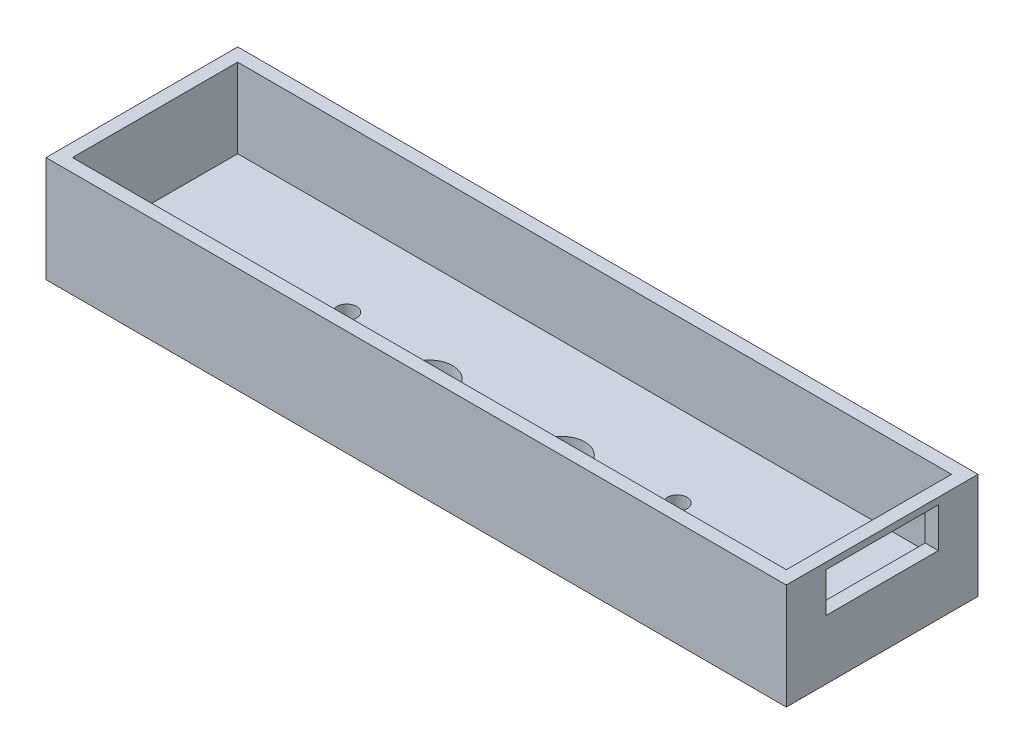
ISO-10303-21;
HEADER;
FILE_DESCRIPTION(('STEP AP214'),'2;1');
FILE_NAME('part.step','',(''),(''),'','','');
FILE_SCHEMA(('AUTOMOTIVE_DESIGN { 1 0 10303 214 1 1 1 1 }'));
ENDSEC;
DATA;
#1=APPLICATION_CONTEXT('core data for automotive mechanical design processes');
#2=APPLICATION_PROTOCOL_DEFINITION('international standard','automotive_design',2000,#1);
#3=PRODUCT_CONTEXT('',#1,'mechanical');
#4=PRODUCT('Part','Part','',(#3));
#5=PRODUCT_RELATED_PRODUCT_CATEGORY('part','',(#4));
#6=PRODUCT_DEFINITION_FORMATION('','',#4);
#7=PRODUCT_DEFINITION_CONTEXT('part definition',#1,'design');
#8=PRODUCT_DEFINITION('design','',#6,#7);
#9=PRODUCT_DEFINITION_SHAPE('','',#8);
#10=(LENGTH_UNIT() NAMED_UNIT(*) SI_UNIT(.MILLI.,.METRE.));
#11=(NAMED_UNIT(*) PLANE_ANGLE_UNIT() SI_UNIT($,.RADIAN.));
#12=(NAMED_UNIT(*) SI_UNIT($,.STERADIAN.) SOLID_ANGLE_UNIT());
#13=UNCERTAINTY_MEASURE_WITH_UNIT(LENGTH_MEASURE(1.E-05),#10,'distance_accuracy_value','');
#14=(GEOMETRIC_REPRESENTATION_CONTEXT(3) GLOBAL_UNCERTAINTY_ASSIGNED_CONTEXT((#13)) GLOBAL_UNIT_ASSIGNED_CONTEXT((#10,
#11,#12)) REPRESENTATION_CONTEXT('',''));
#15=CARTESIAN_POINT('',(0.,0.,0.));
#16=DIRECTION('',(0.,0.,1.));
#17=DIRECTION('',(1.,0.,0.));
#18=AXIS2_PLACEMENT_3D('',#15,#16,#17);
#19=CARTESIAN_POINT('',(1.54454065806863,-0.00100000000000013,-3.78749188362179));
#20=DIRECTION('',(0.,1.,0.));
#21=DIRECTION('',(0.,0.,1.));
#22=AXIS2_PLACEMENT_3D('',#19,#20,#21);
#23=CYLINDRICAL_SURFACE('',#22,1.25);
#24=CARTESIAN_POINT('',(1.54454065806863,0.,-3.78749188362179));
#25=DIRECTION('',(0.,1.,0.));
#26=DIRECTION('',(0.,0.,1.));
#27=AXIS2_PLACEMENT_3D('',#24,#25,#26);
#28=CIRCLE('',#27,1.25);
#29=CARTESIAN_POINT('',(1.54454065806863,0.,-2.53749188362179));
#30=VERTEX_POINT('',#29);
#31=EDGE_CURVE('E299',#30,#30,#28,.F.);
#32=ORIENTED_EDGE('',*,*,#31,.T.);
#33=EDGE_LOOP('',(#32));
#34=FACE_BOUND('',#33,.T.);
#35=CARTESIAN_POINT('',(1.54454065806863,2.3,-3.78749188362179));
#36=DIRECTION('',(0.,1.,0.));
#37=DIRECTION('',(0.,0.,1.));
#38=AXIS2_PLACEMENT_3D('',#35,#36,#37);
#39=CIRCLE('',#38,1.25);
#40=CARTESIAN_POINT('',(1.54454065806863,2.3,-2.53749188362179));
#41=VERTEX_POINT('',#40);
#42=EDGE_CURVE('E115',#41,#41,#39,.F.);
#43=ORIENTED_EDGE('',*,*,#42,.F.);
#44=EDGE_LOOP('',(#43));
#45=FACE_BOUND('',#44,.T.);
#46=ADVANCED_FACE('F111',(#34,#45),#23,.F.);
#47=CARTESIAN_POINT('',(21.5445406580686,-0.00100000000000013,-3.78749188362179));
#48=DIRECTION('',(0.,1.,0.));
#49=DIRECTION('',(0.,0.,1.));
#50=AXIS2_PLACEMENT_3D('',#47,#48,#49);
#51=CYLINDRICAL_SURFACE('',#50,1.25);
#52=CARTESIAN_POINT('',(21.5445406580686,0.,-3.78749188362179));
#53=DIRECTION('',(0.,1.,0.));
#54=DIRECTION('',(0.,0.,1.));
#55=AXIS2_PLACEMENT_3D('',#52,#53,#54);
#56=CIRCLE('',#55,1.25);
#57=CARTESIAN_POINT('',(21.5445406580686,0.,-2.53749188362179));
#58=VERTEX_POINT('',#57);
#59=EDGE_CURVE('E295',#58,#58,#56,.F.);
#60=ORIENTED_EDGE('',*,*,#59,.T.);
#61=EDGE_LOOP('',(#60));
#62=FACE_BOUND('',#61,.T.);
#63=CARTESIAN_POINT('',(21.5445406580686,2.3,-3.78749188362179));
#64=DIRECTION('',(0.,1.,0.));
#65=DIRECTION('',(0.,0.,1.));
#66=AXIS2_PLACEMENT_3D('',#63,#64,#65);
#67=CIRCLE('',#66,1.25);
#68=CARTESIAN_POINT('',(21.5445406580686,2.3,-2.53749188362179));
#69=VERTEX_POINT('',#68);
#70=EDGE_CURVE('E286',#69,#69,#67,.F.);
#71=ORIENTED_EDGE('',*,*,#70,.F.);
#72=EDGE_LOOP('',(#71));
#73=FACE_BOUND('',#72,.T.);
#74=ADVANCED_FACE('F341',(#62,#73),#51,.F.);
#75=CARTESIAN_POINT('',(36.5445406580686,-0.00100000000000013,-6.28749188362179));
#76=DIRECTION('',(0.,1.,0.));
#77=DIRECTION('',(0.,0.,1.));
#78=AXIS2_PLACEMENT_3D('',#75,#76,#77);
#79=CYLINDRICAL_SURFACE('',#78,1.5);
#80=CARTESIAN_POINT('',(36.5445406580686,4.,-6.28749188362179));
#81=DIRECTION('',(0.,1.,0.));
#82=DIRECTION('',(0.,0.,1.));
#83=AXIS2_PLACEMENT_3D('',#80,#81,#82);
#84=CIRCLE('',#83,1.5);
#85=CARTESIAN_POINT('',(36.5445406580686,4.,-4.78749188362179));
#86=VERTEX_POINT('',#85);
#87=EDGE_CURVE('E321',#86,#86,#84,.T.);
#88=ORIENTED_EDGE('',*,*,#87,.T.);
#89=EDGE_LOOP('',(#88));
#90=FACE_BOUND('',#89,.T.);
#91=CARTESIAN_POINT('',(36.5445406580686,2.,-6.28749188362179));
#92=DIRECTION('',(0.,-1.,0.));
#93=DIRECTION('',(0.,0.,-1.));
#94=AXIS2_PLACEMENT_3D('',#91,#92,#93);
#95=CIRCLE('',#94,1.5);
#96=CARTESIAN_POINT('',(36.5445406580686,2.,-7.78749188362179));
#97=VERTEX_POINT('',#96);
#98=EDGE_CURVE('E309',#97,#97,#95,.F.);
#99=ORIENTED_EDGE('',*,*,#98,.F.);
#100=EDGE_LOOP('',(#99));
#101=FACE_BOUND('',#100,.T.);
#102=ADVANCED_FACE('F347',(#90,#101),#79,.F.);
#103=CARTESIAN_POINT('',(-13.4554593419314,-0.00100000000000013,-6.28749188362179));
#104=DIRECTION('',(0.,1.,0.));
#105=DIRECTION('',(0.,0.,1.));
#106=AXIS2_PLACEMENT_3D('',#103,#104,#105);
#107=CYLINDRICAL_SURFACE('',#106,1.5);
#108=CARTESIAN_POINT('',(-13.4554593419314,4.,-6.28749188362179));
#109=DIRECTION('',(0.,1.,0.));
#110=DIRECTION('',(0.,0.,1.));
#111=AXIS2_PLACEMENT_3D('',#108,#109,#110);
#112=CIRCLE('',#111,1.5);
#113=CARTESIAN_POINT('',(-13.4554593419314,4.,-4.78749188362179));
#114=VERTEX_POINT('',#113);
#115=EDGE_CURVE('E317',#114,#114,#112,.T.);
#116=ORIENTED_EDGE('',*,*,#115,.T.);
#117=EDGE_LOOP('',(#116));
#118=FACE_BOUND('',#117,.T.);
#119=CARTESIAN_POINT('',(-13.4554593419314,2.,-6.28749188362179));
#120=DIRECTION('',(0.,-1.,0.));
#121=DIRECTION('',(0.,0.,-1.));
#122=AXIS2_PLACEMENT_3D('',#119,#120,#121);
#123=CIRCLE('',#122,1.5);
#124=CARTESIAN_POINT('',(-13.4554593419314,2.,-7.78749188362179));
#125=VERTEX_POINT('',#124);
#126=EDGE_CURVE('E302',#125,#125,#123,.F.);
#127=ORIENTED_EDGE('',*,*,#126,.F.);
#128=EDGE_LOOP('',(#127));
#129=FACE_BOUND('',#128,.T.);
#130=ADVANCED_FACE('F369',(#118,#129),#107,.F.);
#131=CARTESIAN_POINT('',(0.,4.,0.));
#132=DIRECTION('',(0.,1.,0.));
#133=DIRECTION('',(0.,0.,1.));
#134=AXIS2_PLACEMENT_3D('',#131,#132,#133);
#135=PLANE('',#134);
#136=CARTESIAN_POINT('',(21.5445406580686,4.,-3.78749188362179));
#137=DIRECTION('',(0.,1.,0.));
#138=DIRECTION('',(0.,0.,1.));
#139=AXIS2_PLACEMENT_3D('',#136,#137,#138);
#140=CIRCLE('',#139,3.5);
#141=CARTESIAN_POINT('',(21.5445406580686,4.,-0.287491883621789));
#142=VERTEX_POINT('',#141);
#143=EDGE_CURVE('E287',#142,#142,#140,.T.);
#144=ORIENTED_EDGE('',*,*,#143,.F.);
#145=EDGE_LOOP('',(#144));
#146=FACE_BOUND('',#145,.T.);
#147=CARTESIAN_POINT('',(1.54454065806863,4.,-3.78749188362179));
#148=DIRECTION('',(0.,1.,0.));
#149=DIRECTION('',(0.,0.,1.));
#150=AXIS2_PLACEMENT_3D('',#147,#148,#149);
#151=CIRCLE('',#150,3.5);
#152=CARTESIAN_POINT('',(1.54454065806863,4.,-0.287491883621789));
#153=VERTEX_POINT('',#152);
#154=EDGE_CURVE('E273',#153,#153,#151,.T.);
#155=ORIENTED_EDGE('',*,*,#154,.F.);
#156=EDGE_LOOP('',(#155));
#157=FACE_BOUND('',#156,.T.);
#158=ORIENTED_EDGE('',*,*,#115,.F.);
#159=EDGE_LOOP('',(#158));
#160=FACE_BOUND('',#159,.T.);
#161=ORIENTED_EDGE('',*,*,#87,.F.);
#162=EDGE_LOOP('',(#161));
#163=FACE_BOUND('',#162,.T.);
#164=DIRECTION('',(0.,0.,1.));
#165=VECTOR('',#164,1.);
#166=CARTESIAN_POINT('',(-42.4554593419314,4.,-18.7874918836218));
#167=LINE('',#166,#165);
#168=CARTESIAN_POINT('',(-42.4554593419314,4.,-18.7874918836218));
#169=VERTEX_POINT('',#168);
#170=CARTESIAN_POINT('',(-42.4554593419314,4.,6.21250811637821));
#171=VERTEX_POINT('',#170);
#172=EDGE_CURVE('E320',#169,#171,#167,.T.);
#173=ORIENTED_EDGE('',*,*,#172,.T.);
#174=DIRECTION('',(1.,0.,0.));
#175=VECTOR('',#174,1.);
#176=CARTESIAN_POINT('',(-42.4554593419314,4.,6.21250811637821));
#177=LINE('',#176,#175);
#178=CARTESIAN_POINT('',(65.5445406580686,4.,6.21250811637821));
#179=VERTEX_POINT('',#178);
#180=EDGE_CURVE('E326',#171,#179,#177,.T.);
#181=ORIENTED_EDGE('',*,*,#180,.T.);
#182=DIRECTION('',(0.,0.,-1.));
#183=VECTOR('',#182,1.);
#184=CARTESIAN_POINT('',(65.5445406580686,4.,-18.7874918836218));
#185=LINE('',#184,#183);
#186=CARTESIAN_POINT('',(65.5445406580686,4.,-18.7874918836218));
#187=VERTEX_POINT('',#186);
#188=EDGE_CURVE('E120',#179,#187,#185,.T.);
#189=ORIENTED_EDGE('',*,*,#188,.T.);
#190=DIRECTION('',(-1.,0.,0.));
#191=VECTOR('',#190,1.);
#192=CARTESIAN_POINT('',(-42.4554593419314,4.,-18.7874918836218));
#193=LINE('',#192,#191);
#194=EDGE_CURVE('E12',#187,#169,#193,.T.);
#195=ORIENTED_EDGE('',*,*,#194,.T.);
#196=EDGE_LOOP('',(#173,#181,#189,#195));
#197=FACE_BOUND('',#196,.T.);
#198=ADVANCED_FACE('F372',(#146,#157,#160,#163,#197),#135,.T.);
#199=CARTESIAN_POINT('',(0.,0.,0.));
#200=DIRECTION('',(0.,1.,0.));
#201=DIRECTION('',(0.,0.,1.));
#202=AXIS2_PLACEMENT_3D('',#199,#200,#201);
#203=PLANE('',#202);
#204=ORIENTED_EDGE('',*,*,#59,.F.);
#205=EDGE_LOOP('',(#204));
#206=FACE_BOUND('',#205,.T.);
#207=ORIENTED_EDGE('',*,*,#31,.F.);
#208=EDGE_LOOP('',(#207));
#209=FACE_BOUND('',#208,.T.);
#210=CARTESIAN_POINT('',(-13.4554593419314,0.,-6.28749188362179));
#211=DIRECTION('',(0.,-1.,0.));
#212=DIRECTION('',(0.,0.,-1.));
#213=AXIS2_PLACEMENT_3D('',#210,#211,#212);
#214=CIRCLE('',#213,3.5);
#215=CARTESIAN_POINT('',(-13.4554593419314,0.,-9.78749188362179));
#216=VERTEX_POINT('',#215);
#217=EDGE_CURVE('E306',#216,#216,#214,.T.);
#218=ORIENTED_EDGE('',*,*,#217,.F.);
#219=EDGE_LOOP('',(#218));
#220=FACE_BOUND('',#219,.T.);
#221=CARTESIAN_POINT('',(36.5445406580686,0.,-6.28749188362179));
#222=DIRECTION('',(0.,-1.,0.));
#223=DIRECTION('',(0.,0.,-1.));
#224=AXIS2_PLACEMENT_3D('',#221,#222,#223);
#225=CIRCLE('',#224,3.5);
#226=CARTESIAN_POINT('',(36.5445406580686,0.,-9.78749188362179));
#227=VERTEX_POINT('',#226);
#228=EDGE_CURVE('E312',#227,#227,#225,.T.);
#229=ORIENTED_EDGE('',*,*,#228,.F.);
#230=EDGE_LOOP('',(#229));
#231=FACE_BOUND('',#230,.T.);
#232=DIRECTION('',(-1.,0.,0.));
#233=VECTOR('',#232,1.);
#234=CARTESIAN_POINT('',(0.,0.,-20.7874918836218));
#235=LINE('',#234,#233);
#236=CARTESIAN_POINT('',(67.5445406580686,0.,-20.7874918836218));
#237=VERTEX_POINT('',#236);
#238=CARTESIAN_POINT('',(-44.4554593419314,0.,-20.7874918836218));
#239=VERTEX_POINT('',#238);
#240=EDGE_CURVE('E260',#237,#239,#235,.T.);
#241=ORIENTED_EDGE('',*,*,#240,.F.);
#242=DIRECTION('',(0.,0.,1.));
#243=VECTOR('',#242,1.);
#244=CARTESIAN_POINT('',(67.5445406580686,0.,0.));
#245=LINE('',#244,#243);
#246=CARTESIAN_POINT('',(67.5445406580686,0.,8.21250811637821));
#247=VERTEX_POINT('',#246);
#248=EDGE_CURVE('E268',#237,#247,#245,.T.);
#249=ORIENTED_EDGE('',*,*,#248,.T.);
#250=DIRECTION('',(-1.,0.,0.));
#251=VECTOR('',#250,1.);
#252=CARTESIAN_POINT('',(0.,0.,8.21250811637822));
#253=LINE('',#252,#251);
#254=CARTESIAN_POINT('',(-44.4554593419314,0.,8.21250811637823));
#255=VERTEX_POINT('',#254);
#256=EDGE_CURVE('E266',#247,#255,#253,.T.);
#257=ORIENTED_EDGE('',*,*,#256,.T.);
#258=DIRECTION('',(0.,0.,1.));
#259=VECTOR('',#258,1.);
#260=CARTESIAN_POINT('',(-44.4554593419314,0.,0.));
#261=LINE('',#260,#259);
#262=EDGE_CURVE('E263',#239,#255,#261,.T.);
#263=ORIENTED_EDGE('',*,*,#262,.F.);
#264=EDGE_LOOP('',(#241,#249,#257,#263));
#265=FACE_BOUND('',#264,.T.);
#266=ADVANCED_FACE('F113',(#206,#209,#220,#231,#265),#203,.F.);
#267=CARTESIAN_POINT('',(-13.4554593419314,2.,-6.28749188362179));
#268=DIRECTION('',(0.,-1.,0.));
#269=DIRECTION('',(0.,0.,-1.));
#270=AXIS2_PLACEMENT_3D('',#267,#268,#269);
#271=CYLINDRICAL_SURFACE('',#270,3.5);
#272=CARTESIAN_POINT('',(-13.4554593419314,2.,-6.28749188362179));
#273=DIRECTION('',(0.,-1.,0.));
#274=DIRECTION('',(0.,0.,-1.));
#275=AXIS2_PLACEMENT_3D('',#272,#273,#274);
#276=CIRCLE('',#275,3.5);
#277=CARTESIAN_POINT('',(-13.4554593419314,2.,-9.78749188362179));
#278=VERTEX_POINT('',#277);
#279=EDGE_CURVE('E305',#278,#278,#276,.T.);
#280=ORIENTED_EDGE('',*,*,#279,.F.);
#281=EDGE_LOOP('',(#280));
#282=FACE_BOUND('',#281,.T.);
#283=ORIENTED_EDGE('',*,*,#217,.T.);
#284=EDGE_LOOP('',(#283));
#285=FACE_BOUND('',#284,.T.);
#286=ADVANCED_FACE('F356',(#282,#285),#271,.F.);
#287=CARTESIAN_POINT('',(0.,2.,0.));
#288=DIRECTION('',(0.,-1.,0.));
#289=DIRECTION('',(0.,0.,-1.));
#290=AXIS2_PLACEMENT_3D('',#287,#288,#289);
#291=PLANE('',#290);
#292=ORIENTED_EDGE('',*,*,#126,.T.);
#293=EDGE_LOOP('',(#292));
#294=FACE_BOUND('',#293,.T.);
#295=ORIENTED_EDGE('',*,*,#279,.T.);
#296=EDGE_LOOP('',(#295));
#297=FACE_BOUND('',#296,.T.);
#298=ADVANCED_FACE('F352',(#294,#297),#291,.T.);
#299=CARTESIAN_POINT('',(36.5445406580686,2.,-6.28749188362179));
#300=DIRECTION('',(0.,-1.,0.));
#301=DIRECTION('',(0.,0.,-1.));
#302=AXIS2_PLACEMENT_3D('',#299,#300,#301);
#303=PLANE('',#302);
#304=CARTESIAN_POINT('',(36.5445406580686,2.,-6.28749188362179));
#305=DIRECTION('',(0.,-1.,0.));
#306=DIRECTION('',(0.,0.,-1.));
#307=AXIS2_PLACEMENT_3D('',#304,#305,#306);
#308=CIRCLE('',#307,3.5);
#309=CARTESIAN_POINT('',(36.5445406580686,2.,-9.78749188362179));
#310=VERTEX_POINT('',#309);
#311=EDGE_CURVE('E298',#310,#310,#308,.T.);
#312=ORIENTED_EDGE('',*,*,#311,.T.);
#313=EDGE_LOOP('',(#312));
#314=FACE_BOUND('',#313,.T.);
#315=ORIENTED_EDGE('',*,*,#98,.T.);
#316=EDGE_LOOP('',(#315));
#317=FACE_BOUND('',#316,.T.);
#318=ADVANCED_FACE('F355',(#314,#317),#303,.T.);
#319=CARTESIAN_POINT('',(36.5445406580686,2.,-6.28749188362179));
#320=DIRECTION('',(0.,-1.,0.));
#321=DIRECTION('',(0.,0.,-1.));
#322=AXIS2_PLACEMENT_3D('',#319,#320,#321);
#323=CYLINDRICAL_SURFACE('',#322,3.5);
#324=ORIENTED_EDGE('',*,*,#311,.F.);
#325=EDGE_LOOP('',(#324));
#326=FACE_BOUND('',#325,.T.);
#327=ORIENTED_EDGE('',*,*,#228,.T.);
#328=EDGE_LOOP('',(#327));
#329=FACE_BOUND('',#328,.T.);
#330=ADVANCED_FACE('F361',(#326,#329),#323,.F.);
#331=CARTESIAN_POINT('',(21.5445406580686,2.3,-3.78749188362179));
#332=DIRECTION('',(0.,1.,0.));
#333=DIRECTION('',(0.,0.,1.));
#334=AXIS2_PLACEMENT_3D('',#331,#332,#333);
#335=PLANE('',#334);
#336=CARTESIAN_POINT('',(21.5445406580686,2.3,-3.78749188362179));
#337=DIRECTION('',(0.,1.,0.));
#338=DIRECTION('',(0.,0.,1.));
#339=AXIS2_PLACEMENT_3D('',#336,#337,#338);
#340=CIRCLE('',#339,3.5);
#341=CARTESIAN_POINT('',(21.5445406580686,2.3,-0.287491883621789));
#342=VERTEX_POINT('',#341);
#343=EDGE_CURVE('E283',#342,#342,#340,.T.);
#344=ORIENTED_EDGE('',*,*,#343,.T.);
#345=EDGE_LOOP('',(#344));
#346=FACE_BOUND('',#345,.T.);
#347=ORIENTED_EDGE('',*,*,#70,.T.);
#348=EDGE_LOOP('',(#347));
#349=FACE_BOUND('',#348,.T.);
#350=ADVANCED_FACE('F364',(#346,#349),#335,.T.);
#351=CARTESIAN_POINT('',(21.5445406580686,2.3,-3.78749188362179));
#352=DIRECTION('',(0.,1.,0.));
#353=DIRECTION('',(0.,0.,1.));
#354=AXIS2_PLACEMENT_3D('',#351,#352,#353);
#355=CYLINDRICAL_SURFACE('',#354,3.5);
#356=ORIENTED_EDGE('',*,*,#343,.F.);
#357=EDGE_LOOP('',(#356));
#358=FACE_BOUND('',#357,.T.);
#359=ORIENTED_EDGE('',*,*,#143,.T.);
#360=EDGE_LOOP('',(#359));
#361=FACE_BOUND('',#360,.T.);
#362=ADVANCED_FACE('F439',(#358,#361),#355,.F.);
#363=CARTESIAN_POINT('',(1.54454065806863,2.3,-3.78749188362179));
#364=DIRECTION('',(0.,1.,0.));
#365=DIRECTION('',(0.,0.,1.));
#366=AXIS2_PLACEMENT_3D('',#363,#364,#365);
#367=PLANE('',#366);
#368=CARTESIAN_POINT('',(1.54454065806863,2.3,-3.78749188362179));
#369=DIRECTION('',(0.,1.,0.));
#370=DIRECTION('',(0.,0.,1.));
#371=AXIS2_PLACEMENT_3D('',#368,#369,#370);
#372=CIRCLE('',#371,3.5);
#373=CARTESIAN_POINT('',(1.54454065806863,2.3,-0.287491883621789));
#374=VERTEX_POINT('',#373);
#375=EDGE_CURVE('E290',#374,#374,#372,.T.);
#376=ORIENTED_EDGE('',*,*,#375,.T.);
#377=EDGE_LOOP('',(#376));
#378=FACE_BOUND('',#377,.T.);
#379=ORIENTED_EDGE('',*,*,#42,.T.);
#380=EDGE_LOOP('',(#379));
#381=FACE_BOUND('',#380,.T.);
#382=ADVANCED_FACE('F338',(#378,#381),#367,.T.);
#383=CARTESIAN_POINT('',(1.54454065806863,2.3,-3.78749188362179));
#384=DIRECTION('',(0.,1.,0.));
#385=DIRECTION('',(0.,0.,1.));
#386=AXIS2_PLACEMENT_3D('',#383,#384,#385);
#387=CYLINDRICAL_SURFACE('',#386,3.5);
#388=ORIENTED_EDGE('',*,*,#375,.F.);
#389=EDGE_LOOP('',(#388));
#390=FACE_BOUND('',#389,.T.);
#391=ORIENTED_EDGE('',*,*,#154,.T.);
#392=EDGE_LOOP('',(#391));
#393=FACE_BOUND('',#392,.T.);
#394=ADVANCED_FACE('F412',(#390,#393),#387,.F.);
#395=CARTESIAN_POINT('',(0.,16.,0.));
#396=DIRECTION('',(0.,1.,0.));
#397=DIRECTION('',(0.,0.,1.));
#398=AXIS2_PLACEMENT_3D('',#395,#396,#397);
#399=PLANE('',#398);
#400=DIRECTION('',(0.,0.,1.));
#401=VECTOR('',#400,1.);
#402=CARTESIAN_POINT('',(65.5445406580686,16.,-18.7874918836218));
#403=LINE('',#402,#401);
#404=CARTESIAN_POINT('',(65.5445406580686,16.,-18.7874918836218));
#405=VERTEX_POINT('',#404);
#406=CARTESIAN_POINT('',(65.5445406580686,16.,6.21250811637821));
#407=VERTEX_POINT('',#406);
#408=EDGE_CURVE('E223',#405,#407,#403,.T.);
#409=ORIENTED_EDGE('',*,*,#408,.T.);
#410=DIRECTION('',(-1.,0.,0.));
#411=VECTOR('',#410,1.);
#412=CARTESIAN_POINT('',(0.,16.,6.21250811637822));
#413=LINE('',#412,#411);
#414=CARTESIAN_POINT('',(-42.4554593419314,16.,6.21250811637822));
#415=VERTEX_POINT('',#414);
#416=EDGE_CURVE('E251',#407,#415,#413,.T.);
#417=ORIENTED_EDGE('',*,*,#416,.T.);
#418=DIRECTION('',(0.,0.,1.));
#419=VECTOR('',#418,1.);
#420=CARTESIAN_POINT('',(-42.4554593419314,16.,0.));
#421=LINE('',#420,#419);
#422=CARTESIAN_POINT('',(-42.4554593419314,16.,-18.7874918836218));
#423=VERTEX_POINT('',#422);
#424=EDGE_CURVE('E254',#423,#415,#421,.T.);
#425=ORIENTED_EDGE('',*,*,#424,.F.);
#426=DIRECTION('',(1.,0.,0.));
#427=VECTOR('',#426,1.);
#428=CARTESIAN_POINT('',(0.,16.,-18.7874918836218));
#429=LINE('',#428,#427);
#430=EDGE_CURVE('E257',#423,#405,#429,.T.);
#431=ORIENTED_EDGE('',*,*,#430,.T.);
#432=EDGE_LOOP('',(#409,#417,#425,#431));
#433=FACE_BOUND('',#432,.T.);
#434=DIRECTION('',(-1.,0.,0.));
#435=VECTOR('',#434,1.);
#436=CARTESIAN_POINT('',(0.,16.,-20.7874918836218));
#437=LINE('',#436,#435);
#438=CARTESIAN_POINT('',(67.5445406580686,16.,-20.7874918836218));
#439=VERTEX_POINT('',#438);
#440=CARTESIAN_POINT('',(-44.4554593419314,16.,-20.7874918836218));
#441=VERTEX_POINT('',#440);
#442=EDGE_CURVE('E237',#439,#441,#437,.T.);
#443=ORIENTED_EDGE('',*,*,#442,.T.);
#444=DIRECTION('',(0.,0.,1.));
#445=VECTOR('',#444,1.);
#446=CARTESIAN_POINT('',(-44.4554593419314,16.,0.));
#447=LINE('',#446,#445);
#448=CARTESIAN_POINT('',(-44.4554593419314,16.,8.21250811637823));
#449=VERTEX_POINT('',#448);
#450=EDGE_CURVE('E242',#441,#449,#447,.T.);
#451=ORIENTED_EDGE('',*,*,#450,.T.);
#452=DIRECTION('',(-1.,0.,0.));
#453=VECTOR('',#452,1.);
#454=CARTESIAN_POINT('',(0.,16.,8.21250811637822));
#455=LINE('',#454,#453);
#456=CARTESIAN_POINT('',(67.5445406580686,16.,8.21250811637821));
#457=VERTEX_POINT('',#456);
#458=EDGE_CURVE('E245',#457,#449,#455,.T.);
#459=ORIENTED_EDGE('',*,*,#458,.F.);
#460=DIRECTION('',(0.,0.,1.));
#461=VECTOR('',#460,1.);
#462=CARTESIAN_POINT('',(67.5445406580686,16.,0.));
#463=LINE('',#462,#461);
#464=EDGE_CURVE('E248',#439,#457,#463,.T.);
#465=ORIENTED_EDGE('',*,*,#464,.F.);
#466=EDGE_LOOP('',(#443,#451,#459,#465));
#467=FACE_BOUND('',#466,.T.);
#468=ADVANCED_FACE('F400',(#433,#467),#399,.T.);
#469=CARTESIAN_POINT('',(65.5445406580686,16.,-18.7874918836218));
#470=DIRECTION('',(1.,0.,0.));
#471=DIRECTION('',(0.,0.,-1.));
#472=AXIS2_PLACEMENT_3D('',#469,#470,#471);
#473=PLANE('',#472);
#474=DIRECTION('',(0.,0.,-1.));
#475=VECTOR('',#474,1.);
#476=CARTESIAN_POINT('',(65.5445406580686,15.,2.21250811637821));
#477=LINE('',#476,#475);
#478=CARTESIAN_POINT('',(65.5445406580686,15.,2.21250811637821));
#479=VERTEX_POINT('',#478);
#480=CARTESIAN_POINT('',(65.5445406580686,15.,-14.7874918836218));
#481=VERTEX_POINT('',#480);
#482=EDGE_CURVE('E206',#479,#481,#477,.T.);
#483=ORIENTED_EDGE('',*,*,#482,.F.);
#484=DIRECTION('',(0.,1.,0.));
#485=VECTOR('',#484,1.);
#486=CARTESIAN_POINT('',(65.5445406580686,9.,2.21250811637821));
#487=LINE('',#486,#485);
#488=CARTESIAN_POINT('',(65.5445406580686,9.,2.21250811637821));
#489=VERTEX_POINT('',#488);
#490=EDGE_CURVE('E213',#489,#479,#487,.T.);
#491=ORIENTED_EDGE('',*,*,#490,.F.);
#492=DIRECTION('',(0.,0.,1.));
#493=VECTOR('',#492,1.);
#494=CARTESIAN_POINT('',(65.5445406580686,9.,2.21250811637821));
#495=LINE('',#494,#493);
#496=CARTESIAN_POINT('',(65.5445406580686,9.,-14.7874918836218));
#497=VERTEX_POINT('',#496);
#498=EDGE_CURVE('E218',#497,#489,#495,.T.);
#499=ORIENTED_EDGE('',*,*,#498,.F.);
#500=DIRECTION('',(0.,-1.,0.));
#501=VECTOR('',#500,1.);
#502=CARTESIAN_POINT('',(65.5445406580686,9.,-14.7874918836218));
#503=LINE('',#502,#501);
#504=EDGE_CURVE('E128',#481,#497,#503,.T.);
#505=ORIENTED_EDGE('',*,*,#504,.F.);
#506=EDGE_LOOP('',(#483,#491,#499,#505));
#507=FACE_BOUND('',#506,.T.);
#508=ORIENTED_EDGE('',*,*,#188,.F.);
#509=DIRECTION('',(0.,-1.,0.));
#510=VECTOR('',#509,1.);
#511=CARTESIAN_POINT('',(65.5445406580686,16.,6.21250811637821));
#512=LINE('',#511,#510);
#513=EDGE_CURVE('E233',#407,#179,#512,.T.);
#514=ORIENTED_EDGE('',*,*,#513,.F.);
#515=ORIENTED_EDGE('',*,*,#408,.F.);
#516=DIRECTION('',(0.,-1.,0.));
#517=VECTOR('',#516,1.);
#518=CARTESIAN_POINT('',(65.5445406580686,16.,-18.7874918836218));
#519=LINE('',#518,#517);
#520=EDGE_CURVE('E234',#405,#187,#519,.T.);
#521=ORIENTED_EDGE('',*,*,#520,.T.);
#522=EDGE_LOOP('',(#508,#514,#515,#521));
#523=FACE_BOUND('',#522,.T.);
#524=ADVANCED_FACE('F220',(#507,#523),#473,.F.);
#525=CARTESIAN_POINT('',(0.,0.,-18.7874918836218));
#526=DIRECTION('',(0.,0.,1.));
#527=DIRECTION('',(1.,0.,0.));
#528=AXIS2_PLACEMENT_3D('',#525,#526,#527);
#529=PLANE('',#528);
#530=DIRECTION('',(0.,1.,0.));
#531=VECTOR('',#530,1.);
#532=CARTESIAN_POINT('',(-42.4554593419314,0.,-18.7874918836218));
#533=LINE('',#532,#531);
#534=EDGE_CURVE('E274',#169,#423,#533,.T.);
#535=ORIENTED_EDGE('',*,*,#534,.F.);
#536=ORIENTED_EDGE('',*,*,#194,.F.);
#537=ORIENTED_EDGE('',*,*,#520,.F.);
#538=ORIENTED_EDGE('',*,*,#430,.F.);
#539=EDGE_LOOP('',(#535,#536,#537,#538));
#540=FACE_BOUND('',#539,.T.);
#541=ADVANCED_FACE('F396',(#540),#529,.T.);
#542=CARTESIAN_POINT('',(0.,0.,6.21250811637822));
#543=DIRECTION('',(0.,0.,-1.));
#544=DIRECTION('',(-1.,0.,0.));
#545=AXIS2_PLACEMENT_3D('',#542,#543,#544);
#546=PLANE('',#545);
#547=ORIENTED_EDGE('',*,*,#513,.T.);
#548=ORIENTED_EDGE('',*,*,#180,.F.);
#549=DIRECTION('',(0.,1.,0.));
#550=VECTOR('',#549,1.);
#551=CARTESIAN_POINT('',(-42.4554593419314,0.,6.21250811637822));
#552=LINE('',#551,#550);
#553=EDGE_CURVE('E276',#171,#415,#552,.T.);
#554=ORIENTED_EDGE('',*,*,#553,.T.);
#555=ORIENTED_EDGE('',*,*,#416,.F.);
#556=EDGE_LOOP('',(#547,#548,#554,#555));
#557=FACE_BOUND('',#556,.T.);
#558=ADVANCED_FACE('F404',(#557),#546,.T.);
#559=CARTESIAN_POINT('',(0.,0.,-20.7874918836218));
#560=DIRECTION('',(0.,0.,-1.));
#561=DIRECTION('',(-1.,0.,0.));
#562=AXIS2_PLACEMENT_3D('',#559,#560,#561);
#563=PLANE('',#562);
#564=DIRECTION('',(0.,1.,0.));
#565=VECTOR('',#564,1.);
#566=CARTESIAN_POINT('',(-44.4554593419314,0.,-20.7874918836218));
#567=LINE('',#566,#565);
#568=EDGE_CURVE('E270',#239,#441,#567,.T.);
#569=ORIENTED_EDGE('',*,*,#568,.T.);
#570=ORIENTED_EDGE('',*,*,#442,.F.);
#571=DIRECTION('',(0.,1.,0.));
#572=VECTOR('',#571,1.);
#573=CARTESIAN_POINT('',(67.5445406580686,0.,-20.7874918836218));
#574=LINE('',#573,#572);
#575=EDGE_CURVE('E271',#237,#439,#574,.T.);
#576=ORIENTED_EDGE('',*,*,#575,.F.);
#577=ORIENTED_EDGE('',*,*,#240,.T.);
#578=EDGE_LOOP('',(#569,#570,#576,#577));
#579=FACE_BOUND('',#578,.T.);
#580=ADVANCED_FACE('F419',(#579),#563,.T.);
#581=CARTESIAN_POINT('',(67.5445406580686,0.,0.));
#582=DIRECTION('',(-1.,0.,0.));
#583=DIRECTION('',(0.,0.,1.));
#584=AXIS2_PLACEMENT_3D('',#581,#582,#583);
#585=PLANE('',#584);
#586=DIRECTION('',(0.,0.,-1.));
#587=VECTOR('',#586,1.);
#588=CARTESIAN_POINT('',(67.5445406580686,9.,2.21250811637821));
#589=LINE('',#588,#587);
#590=CARTESIAN_POINT('',(67.5445406580686,9.,2.21250811637821));
#591=VERTEX_POINT('',#590);
#592=CARTESIAN_POINT('',(67.5445406580686,9.,-14.7874918836218));
#593=VERTEX_POINT('',#592);
#594=EDGE_CURVE('E562',#591,#593,#589,.T.);
#595=ORIENTED_EDGE('',*,*,#594,.F.);
#596=DIRECTION('',(0.,-1.,0.));
#597=VECTOR('',#596,1.);
#598=CARTESIAN_POINT('',(67.5445406580686,9.,2.21250811637821));
#599=LINE('',#598,#597);
#600=CARTESIAN_POINT('',(67.5445406580686,15.,2.21250811637821));
#601=VERTEX_POINT('',#600);
#602=EDGE_CURVE('E136',#601,#591,#599,.T.);
#603=ORIENTED_EDGE('',*,*,#602,.F.);
#604=DIRECTION('',(0.,0.,1.));
#605=VECTOR('',#604,1.);
#606=CARTESIAN_POINT('',(67.5445406580686,15.,2.21250811637821));
#607=LINE('',#606,#605);
#608=CARTESIAN_POINT('',(67.5445406580686,15.,-14.7874918836218));
#609=VERTEX_POINT('',#608);
#610=EDGE_CURVE('E208',#609,#601,#607,.T.);
#611=ORIENTED_EDGE('',*,*,#610,.F.);
#612=DIRECTION('',(0.,1.,0.));
#613=VECTOR('',#612,1.);
#614=CARTESIAN_POINT('',(67.5445406580686,9.,-14.7874918836218));
#615=LINE('',#614,#613);
#616=EDGE_CURVE('E557',#593,#609,#615,.T.);
#617=ORIENTED_EDGE('',*,*,#616,.F.);
#618=EDGE_LOOP('',(#595,#603,#611,#617));
#619=FACE_BOUND('',#618,.T.);
#620=ORIENTED_EDGE('',*,*,#575,.T.);
#621=ORIENTED_EDGE('',*,*,#464,.T.);
#622=DIRECTION('',(0.,1.,0.));
#623=VECTOR('',#622,1.);
#624=CARTESIAN_POINT('',(67.5445406580686,0.,8.21250811637821));
#625=LINE('',#624,#623);
#626=EDGE_CURVE('E278',#247,#457,#625,.T.);
#627=ORIENTED_EDGE('',*,*,#626,.F.);
#628=ORIENTED_EDGE('',*,*,#248,.F.);
#629=EDGE_LOOP('',(#620,#621,#627,#628));
#630=FACE_BOUND('',#629,.T.);
#631=ADVANCED_FACE('F417',(#619,#630),#585,.F.);
#632=CARTESIAN_POINT('',(-42.4554593419314,0.,0.));
#633=DIRECTION('',(-1.,0.,0.));
#634=DIRECTION('',(0.,0.,1.));
#635=AXIS2_PLACEMENT_3D('',#632,#633,#634);
#636=PLANE('',#635);
#637=ORIENTED_EDGE('',*,*,#172,.F.);
#638=ORIENTED_EDGE('',*,*,#534,.T.);
#639=ORIENTED_EDGE('',*,*,#424,.T.);
#640=ORIENTED_EDGE('',*,*,#553,.F.);
#641=EDGE_LOOP('',(#637,#638,#639,#640));
#642=FACE_BOUND('',#641,.T.);
#643=ADVANCED_FACE('F393',(#642),#636,.F.);
#644=CARTESIAN_POINT('',(0.,0.,8.21250811637822));
#645=DIRECTION('',(0.,0.,-1.));
#646=DIRECTION('',(-1.,0.,0.));
#647=AXIS2_PLACEMENT_3D('',#644,#645,#646);
#648=PLANE('',#647);
#649=ORIENTED_EDGE('',*,*,#626,.T.);
#650=ORIENTED_EDGE('',*,*,#458,.T.);
#651=DIRECTION('',(0.,1.,0.));
#652=VECTOR('',#651,1.);
#653=CARTESIAN_POINT('',(-44.4554593419314,0.,8.21250811637823));
#654=LINE('',#653,#652);
#655=EDGE_CURVE('E280',#255,#449,#654,.T.);
#656=ORIENTED_EDGE('',*,*,#655,.F.);
#657=ORIENTED_EDGE('',*,*,#256,.F.);
#658=EDGE_LOOP('',(#649,#650,#656,#657));
#659=FACE_BOUND('',#658,.T.);
#660=ADVANCED_FACE('F424',(#659),#648,.F.);
#661=CARTESIAN_POINT('',(-44.4554593419314,0.,0.));
#662=DIRECTION('',(-1.,0.,0.));
#663=DIRECTION('',(0.,0.,1.));
#664=AXIS2_PLACEMENT_3D('',#661,#662,#663);
#665=PLANE('',#664);
#666=ORIENTED_EDGE('',*,*,#655,.T.);
#667=ORIENTED_EDGE('',*,*,#450,.F.);
#668=ORIENTED_EDGE('',*,*,#568,.F.);
#669=ORIENTED_EDGE('',*,*,#262,.T.);
#670=EDGE_LOOP('',(#666,#667,#668,#669));
#671=FACE_BOUND('',#670,.T.);
#672=ADVANCED_FACE('F429',(#671),#665,.T.);
#673=CARTESIAN_POINT('',(-44.4564593419314,9.,2.21250811637821));
#674=DIRECTION('',(0.,0.,1.));
#675=DIRECTION('',(1.,0.,0.));
#676=AXIS2_PLACEMENT_3D('',#673,#674,#675);
#677=PLANE('',#676);
#678=ORIENTED_EDGE('',*,*,#490,.T.);
#679=DIRECTION('',(1.,0.,0.));
#680=VECTOR('',#679,1.);
#681=CARTESIAN_POINT('',(-44.4564593419314,15.,2.21250811637821));
#682=LINE('',#681,#680);
#683=EDGE_CURVE('E202',#479,#601,#682,.T.);
#684=ORIENTED_EDGE('',*,*,#683,.T.);
#685=ORIENTED_EDGE('',*,*,#602,.T.);
#686=DIRECTION('',(1.,0.,0.));
#687=VECTOR('',#686,1.);
#688=CARTESIAN_POINT('',(-44.4564593419314,9.,2.21250811637821));
#689=LINE('',#688,#687);
#690=EDGE_CURVE('E210',#489,#591,#689,.T.);
#691=ORIENTED_EDGE('',*,*,#690,.F.);
#692=EDGE_LOOP('',(#678,#684,#685,#691));
#693=FACE_BOUND('',#692,.T.);
#694=ADVANCED_FACE('F214',(#693),#677,.F.);
#695=CARTESIAN_POINT('',(-44.4564593419314,15.,2.21250811637821));
#696=DIRECTION('',(0.,1.,0.));
#697=DIRECTION('',(0.,0.,1.));
#698=AXIS2_PLACEMENT_3D('',#695,#696,#697);
#699=PLANE('',#698);
#700=ORIENTED_EDGE('',*,*,#482,.T.);
#701=DIRECTION('',(1.,0.,0.));
#702=VECTOR('',#701,1.);
#703=CARTESIAN_POINT('',(-44.4564593419314,15.,-14.7874918836218));
#704=LINE('',#703,#702);
#705=EDGE_CURVE('E209',#481,#609,#704,.T.);
#706=ORIENTED_EDGE('',*,*,#705,.T.);
#707=ORIENTED_EDGE('',*,*,#610,.T.);
#708=ORIENTED_EDGE('',*,*,#683,.F.);
#709=EDGE_LOOP('',(#700,#706,#707,#708));
#710=FACE_BOUND('',#709,.T.);
#711=ADVANCED_FACE('F204',(#710),#699,.F.);
#712=CARTESIAN_POINT('',(-44.4564593419314,9.,-14.7874918836218));
#713=DIRECTION('',(0.,0.,-1.));
#714=DIRECTION('',(-1.,0.,0.));
#715=AXIS2_PLACEMENT_3D('',#712,#713,#714);
#716=PLANE('',#715);
#717=ORIENTED_EDGE('',*,*,#504,.T.);
#718=DIRECTION('',(1.,0.,0.));
#719=VECTOR('',#718,1.);
#720=CARTESIAN_POINT('',(-44.4564593419314,9.,-14.7874918836218));
#721=LINE('',#720,#719);
#722=EDGE_CURVE('E228',#497,#593,#721,.T.);
#723=ORIENTED_EDGE('',*,*,#722,.T.);
#724=ORIENTED_EDGE('',*,*,#616,.T.);
#725=ORIENTED_EDGE('',*,*,#705,.F.);
#726=EDGE_LOOP('',(#717,#723,#724,#725));
#727=FACE_BOUND('',#726,.T.);
#728=ADVANCED_FACE('F533',(#727),#716,.F.);
#729=CARTESIAN_POINT('',(-44.4564593419314,9.,2.21250811637821));
#730=DIRECTION('',(0.,-1.,0.));
#731=DIRECTION('',(0.,0.,-1.));
#732=AXIS2_PLACEMENT_3D('',#729,#730,#731);
#733=PLANE('',#732);
#734=ORIENTED_EDGE('',*,*,#498,.T.);
#735=ORIENTED_EDGE('',*,*,#690,.T.);
#736=ORIENTED_EDGE('',*,*,#594,.T.);
#737=ORIENTED_EDGE('',*,*,#722,.F.);
#738=EDGE_LOOP('',(#734,#735,#736,#737));
#739=FACE_BOUND('',#738,.T.);
#740=ADVANCED_FACE('F541',(#739),#733,.F.);
#741=CLOSED_SHELL('',(#46,#74,#102,#130,#198,#266,#286,#298,#318,#330,#350,#362,#382,#394,#468,
#524,#541,#558,#580,#631,#643,#660,#672,#694,#711,#728,#740));
#742=MANIFOLD_SOLID_BREP('B2',#741);
#743=ADVANCED_BREP_SHAPE_REPRESENTATION('',(#18,#742),#14);
#744=SHAPE_DEFINITION_REPRESENTATION(#9,#743);
ENDSEC;
END-ISO-10303-21;
